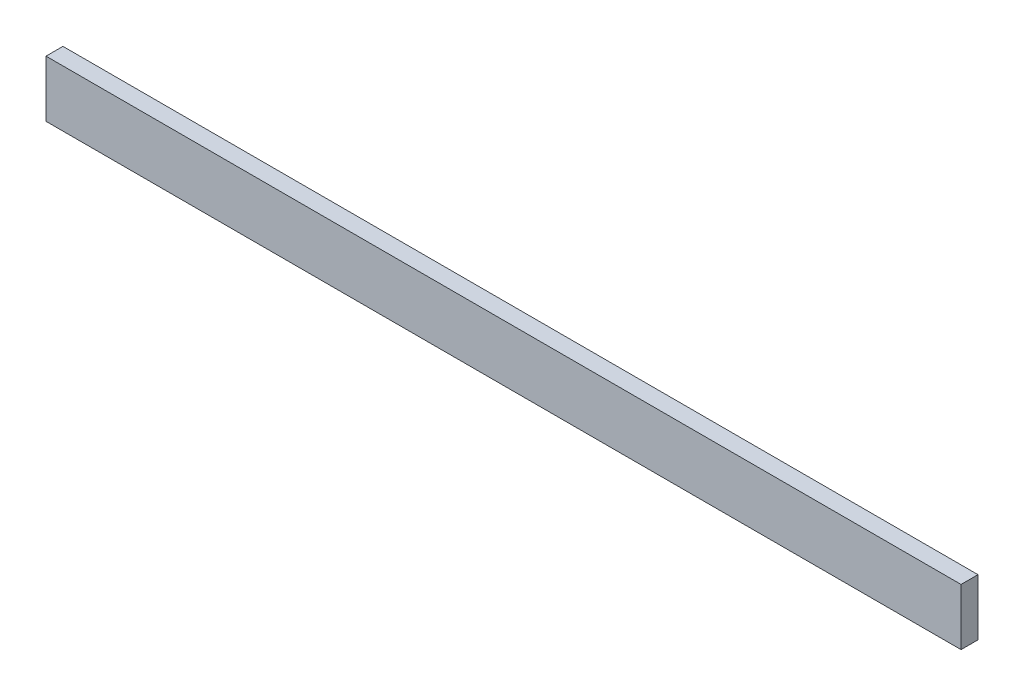
ISO-10303-21;
HEADER;
FILE_DESCRIPTION(('STEP AP214'),'2;1');
FILE_NAME('part.step','',(''),(''),'','','');
FILE_SCHEMA(('AUTOMOTIVE_DESIGN { 1 0 10303 214 1 1 1 1 }'));
ENDSEC;
DATA;
#1=APPLICATION_CONTEXT('core data for automotive mechanical design processes');
#2=APPLICATION_PROTOCOL_DEFINITION('international standard','automotive_design',2000,#1);
#3=PRODUCT_CONTEXT('',#1,'mechanical');
#4=PRODUCT('Part','Part','',(#3));
#5=PRODUCT_RELATED_PRODUCT_CATEGORY('part','',(#4));
#6=PRODUCT_DEFINITION_FORMATION('','',#4);
#7=PRODUCT_DEFINITION_CONTEXT('part definition',#1,'design');
#8=PRODUCT_DEFINITION('design','',#6,#7);
#9=PRODUCT_DEFINITION_SHAPE('','',#8);
#10=(LENGTH_UNIT() NAMED_UNIT(*) SI_UNIT(.MILLI.,.METRE.));
#11=(NAMED_UNIT(*) PLANE_ANGLE_UNIT() SI_UNIT($,.RADIAN.));
#12=(NAMED_UNIT(*) SI_UNIT($,.STERADIAN.) SOLID_ANGLE_UNIT());
#13=UNCERTAINTY_MEASURE_WITH_UNIT(LENGTH_MEASURE(1.E-05),#10,'distance_accuracy_value','');
#14=(GEOMETRIC_REPRESENTATION_CONTEXT(3) GLOBAL_UNCERTAINTY_ASSIGNED_CONTEXT((#13)) GLOBAL_UNIT_ASSIGNED_CONTEXT((#10,
#11,#12)) REPRESENTATION_CONTEXT('',''));
#15=CARTESIAN_POINT('',(0.,0.,0.));
#16=DIRECTION('',(0.,0.,1.));
#17=DIRECTION('',(1.,0.,0.));
#18=AXIS2_PLACEMENT_3D('',#15,#16,#17);
#19=CARTESIAN_POINT('',(-514.35,-31.75,-9.525));
#20=DIRECTION('',(0.,0.,-1.));
#21=DIRECTION('',(-1.,0.,0.));
#22=AXIS2_PLACEMENT_3D('',#19,#20,#21);
#23=PLANE('',#22);
#24=DIRECTION('',(1.,0.,0.));
#25=VECTOR('',#24,1.);
#26=CARTESIAN_POINT('',(-514.35,31.75,-9.525));
#27=LINE('',#26,#25);
#28=CARTESIAN_POINT('',(-514.35,31.75,-9.525));
#29=VERTEX_POINT('',#28);
#30=CARTESIAN_POINT('',(514.35,31.75,-9.525));
#31=VERTEX_POINT('',#30);
#32=EDGE_CURVE('E35',#29,#31,#27,.T.);
#33=ORIENTED_EDGE('',*,*,#32,.T.);
#34=DIRECTION('',(0.,1.,0.));
#35=VECTOR('',#34,1.);
#36=CARTESIAN_POINT('',(514.35,-31.75,-9.525));
#37=LINE('',#36,#35);
#38=CARTESIAN_POINT('',(514.35,-31.75,-9.525));
#39=VERTEX_POINT('',#38);
#40=EDGE_CURVE('E72',#39,#31,#37,.T.);
#41=ORIENTED_EDGE('',*,*,#40,.F.);
#42=DIRECTION('',(1.,0.,0.));
#43=VECTOR('',#42,1.);
#44=CARTESIAN_POINT('',(-514.35,-31.75,-9.525));
#45=LINE('',#44,#43);
#46=CARTESIAN_POINT('',(-514.35,-31.75,-9.525));
#47=VERTEX_POINT('',#46);
#48=EDGE_CURVE('E11',#47,#39,#45,.T.);
#49=ORIENTED_EDGE('',*,*,#48,.F.);
#50=DIRECTION('',(0.,1.,0.));
#51=VECTOR('',#50,1.);
#52=CARTESIAN_POINT('',(-514.35,-31.75,-9.525));
#53=LINE('',#52,#51);
#54=EDGE_CURVE('E73',#47,#29,#53,.T.);
#55=ORIENTED_EDGE('',*,*,#54,.T.);
#56=EDGE_LOOP('',(#33,#41,#49,#55));
#57=FACE_BOUND('',#56,.T.);
#58=ADVANCED_FACE('F32',(#57),#23,.T.);
#59=CARTESIAN_POINT('',(-514.35,-31.75,9.525));
#60=DIRECTION('',(0.,-1.,0.));
#61=DIRECTION('',(0.,0.,-1.));
#62=AXIS2_PLACEMENT_3D('',#59,#60,#61);
#63=PLANE('',#62);
#64=ORIENTED_EDGE('',*,*,#48,.T.);
#65=DIRECTION('',(0.,0.,-1.));
#66=VECTOR('',#65,1.);
#67=CARTESIAN_POINT('',(514.35,-31.75,9.525));
#68=LINE('',#67,#66);
#69=CARTESIAN_POINT('',(514.35,-31.75,9.525));
#70=VERTEX_POINT('',#69);
#71=EDGE_CURVE('E89',#70,#39,#68,.T.);
#72=ORIENTED_EDGE('',*,*,#71,.F.);
#73=DIRECTION('',(1.,0.,0.));
#74=VECTOR('',#73,1.);
#75=CARTESIAN_POINT('',(-514.35,-31.75,9.525));
#76=LINE('',#75,#74);
#77=CARTESIAN_POINT('',(-514.35,-31.75,9.525));
#78=VERTEX_POINT('',#77);
#79=EDGE_CURVE('E40',#78,#70,#76,.T.);
#80=ORIENTED_EDGE('',*,*,#79,.F.);
#81=DIRECTION('',(0.,0.,-1.));
#82=VECTOR('',#81,1.);
#83=CARTESIAN_POINT('',(-514.35,-31.75,9.525));
#84=LINE('',#83,#82);
#85=EDGE_CURVE('E78',#78,#47,#84,.T.);
#86=ORIENTED_EDGE('',*,*,#85,.T.);
#87=EDGE_LOOP('',(#64,#72,#80,#86));
#88=FACE_BOUND('',#87,.T.);
#89=ADVANCED_FACE('F104',(#88),#63,.T.);
#90=CARTESIAN_POINT('',(-514.35,-31.75,9.525));
#91=DIRECTION('',(0.,0.,1.));
#92=DIRECTION('',(1.,0.,0.));
#93=AXIS2_PLACEMENT_3D('',#90,#91,#92);
#94=PLANE('',#93);
#95=ORIENTED_EDGE('',*,*,#79,.T.);
#96=DIRECTION('',(0.,-1.,0.));
#97=VECTOR('',#96,1.);
#98=CARTESIAN_POINT('',(514.35,-31.75,9.525));
#99=LINE('',#98,#97);
#100=CARTESIAN_POINT('',(514.35,31.75,9.525));
#101=VERTEX_POINT('',#100);
#102=EDGE_CURVE('E85',#101,#70,#99,.T.);
#103=ORIENTED_EDGE('',*,*,#102,.F.);
#104=DIRECTION('',(1.,0.,0.));
#105=VECTOR('',#104,1.);
#106=CARTESIAN_POINT('',(-514.35,31.75,9.525));
#107=LINE('',#106,#105);
#108=CARTESIAN_POINT('',(-514.35,31.75,9.525));
#109=VERTEX_POINT('',#108);
#110=EDGE_CURVE('E77',#109,#101,#107,.T.);
#111=ORIENTED_EDGE('',*,*,#110,.F.);
#112=DIRECTION('',(0.,-1.,0.));
#113=VECTOR('',#112,1.);
#114=CARTESIAN_POINT('',(-514.35,-31.75,9.525));
#115=LINE('',#114,#113);
#116=EDGE_CURVE('E97',#109,#78,#115,.T.);
#117=ORIENTED_EDGE('',*,*,#116,.T.);
#118=EDGE_LOOP('',(#95,#103,#111,#117));
#119=FACE_BOUND('',#118,.T.);
#120=ADVANCED_FACE('F101',(#119),#94,.T.);
#121=CARTESIAN_POINT('',(-514.35,31.75,9.525));
#122=DIRECTION('',(0.,1.,0.));
#123=DIRECTION('',(0.,0.,1.));
#124=AXIS2_PLACEMENT_3D('',#121,#122,#123);
#125=PLANE('',#124);
#126=ORIENTED_EDGE('',*,*,#110,.T.);
#127=DIRECTION('',(0.,0.,1.));
#128=VECTOR('',#127,1.);
#129=CARTESIAN_POINT('',(514.35,31.75,9.525));
#130=LINE('',#129,#128);
#131=EDGE_CURVE('E80',#31,#101,#130,.T.);
#132=ORIENTED_EDGE('',*,*,#131,.F.);
#133=ORIENTED_EDGE('',*,*,#32,.F.);
#134=DIRECTION('',(0.,0.,1.));
#135=VECTOR('',#134,1.);
#136=CARTESIAN_POINT('',(-514.35,31.75,9.525));
#137=LINE('',#136,#135);
#138=EDGE_CURVE('E95',#29,#109,#137,.T.);
#139=ORIENTED_EDGE('',*,*,#138,.T.);
#140=EDGE_LOOP('',(#126,#132,#133,#139));
#141=FACE_BOUND('',#140,.T.);
#142=ADVANCED_FACE('F81',(#141),#125,.T.);
#143=CARTESIAN_POINT('',(-514.35,0.,0.));
#144=DIRECTION('',(-1.,0.,0.));
#145=DIRECTION('',(0.,0.,1.));
#146=AXIS2_PLACEMENT_3D('',#143,#144,#145);
#147=PLANE('',#146);
#148=ORIENTED_EDGE('',*,*,#54,.F.);
#149=ORIENTED_EDGE('',*,*,#85,.F.);
#150=ORIENTED_EDGE('',*,*,#116,.F.);
#151=ORIENTED_EDGE('',*,*,#138,.F.);
#152=EDGE_LOOP('',(#148,#149,#150,#151));
#153=FACE_BOUND('',#152,.T.);
#154=ADVANCED_FACE('F106',(#153),#147,.T.);
#155=CARTESIAN_POINT('',(514.35,0.,0.));
#156=DIRECTION('',(-1.,0.,0.));
#157=DIRECTION('',(0.,0.,1.));
#158=AXIS2_PLACEMENT_3D('',#155,#156,#157);
#159=PLANE('',#158);
#160=ORIENTED_EDGE('',*,*,#40,.T.);
#161=ORIENTED_EDGE('',*,*,#131,.T.);
#162=ORIENTED_EDGE('',*,*,#102,.T.);
#163=ORIENTED_EDGE('',*,*,#71,.T.);
#164=EDGE_LOOP('',(#160,#161,#162,#163));
#165=FACE_BOUND('',#164,.T.);
#166=ADVANCED_FACE('F88',(#165),#159,.F.);
#167=CLOSED_SHELL('',(#58,#89,#120,#142,#154,#166));
#168=MANIFOLD_SOLID_BREP('B2',#167);
#169=ADVANCED_BREP_SHAPE_REPRESENTATION('',(#18,#168),#14);
#170=SHAPE_DEFINITION_REPRESENTATION(#9,#169);
ENDSEC;
END-ISO-10303-21;
